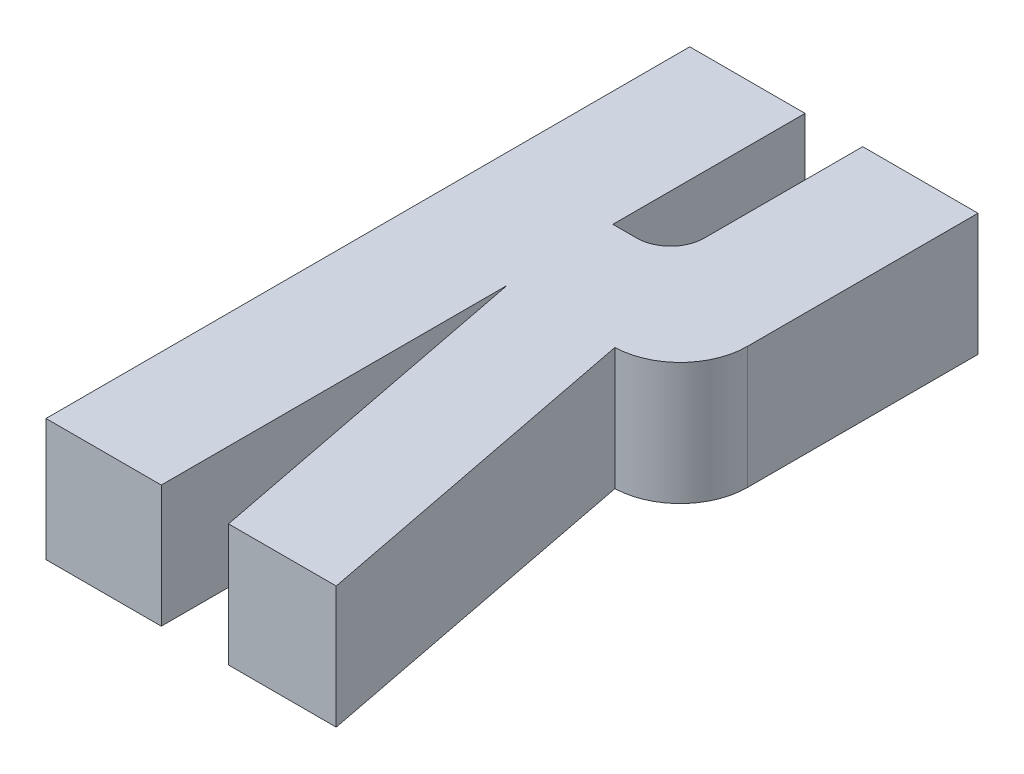
ISO-10303-21;
HEADER;
FILE_DESCRIPTION(('STEP AP214'),'2;1');
FILE_NAME('part.step','',(''),(''),'','','');
FILE_SCHEMA(('AUTOMOTIVE_DESIGN { 1 0 10303 214 1 1 1 1 }'));
ENDSEC;
DATA;
#1=APPLICATION_CONTEXT('core data for automotive mechanical design processes');
#2=APPLICATION_PROTOCOL_DEFINITION('international standard','automotive_design',2000,#1);
#3=PRODUCT_CONTEXT('',#1,'mechanical');
#4=PRODUCT('Part','Part','',(#3));
#5=PRODUCT_RELATED_PRODUCT_CATEGORY('part','',(#4));
#6=PRODUCT_DEFINITION_FORMATION('','',#4);
#7=PRODUCT_DEFINITION_CONTEXT('part definition',#1,'design');
#8=PRODUCT_DEFINITION('design','',#6,#7);
#9=PRODUCT_DEFINITION_SHAPE('','',#8);
#10=(LENGTH_UNIT() NAMED_UNIT(*) SI_UNIT(.MILLI.,.METRE.));
#11=(NAMED_UNIT(*) PLANE_ANGLE_UNIT() SI_UNIT($,.RADIAN.));
#12=(NAMED_UNIT(*) SI_UNIT($,.STERADIAN.) SOLID_ANGLE_UNIT());
#13=UNCERTAINTY_MEASURE_WITH_UNIT(LENGTH_MEASURE(1.E-05),#10,'distance_accuracy_value','');
#14=(GEOMETRIC_REPRESENTATION_CONTEXT(3) GLOBAL_UNCERTAINTY_ASSIGNED_CONTEXT((#13)) GLOBAL_UNIT_ASSIGNED_CONTEXT((#10,
#11,#12)) REPRESENTATION_CONTEXT('',''));
#15=CARTESIAN_POINT('',(0.,0.,0.));
#16=DIRECTION('',(0.,0.,1.));
#17=DIRECTION('',(1.,0.,0.));
#18=AXIS2_PLACEMENT_3D('',#15,#16,#17);
#19=CARTESIAN_POINT('',(795.538613054072,-71.,1297.8980276768));
#20=DIRECTION('',(1.,0.,0.));
#21=DIRECTION('',(0.,0.,-1.));
#22=AXIS2_PLACEMENT_3D('',#19,#20,#21);
#23=PLANE('',#22);
#24=DIRECTION('',(0.,0.,1.));
#25=VECTOR('',#24,1.);
#26=CARTESIAN_POINT('',(795.538613054072,-79.,1297.8980276768));
#27=LINE('',#26,#25);
#28=CARTESIAN_POINT('',(795.538613054072,-79.,1297.8980276768));
#29=VERTEX_POINT('',#28);
#30=CARTESIAN_POINT('',(795.538613054072,-79.,1340.0191783547));
#31=VERTEX_POINT('',#30);
#32=EDGE_CURVE('E123',#29,#31,#27,.T.);
#33=ORIENTED_EDGE('',*,*,#32,.T.);
#34=DIRECTION('',(0.,-1.,0.));
#35=VECTOR('',#34,1.);
#36=CARTESIAN_POINT('',(795.538613054072,-71.,1340.0191783547));
#37=LINE('',#36,#35);
#38=CARTESIAN_POINT('',(795.538613054072,-71.,1340.0191783547));
#39=VERTEX_POINT('',#38);
#40=EDGE_CURVE('E11',#39,#31,#37,.T.);
#41=ORIENTED_EDGE('',*,*,#40,.F.);
#42=DIRECTION('',(0.,0.,1.));
#43=VECTOR('',#42,1.);
#44=CARTESIAN_POINT('',(795.538613054072,-71.,1297.8980276768));
#45=LINE('',#44,#43);
#46=CARTESIAN_POINT('',(795.538613054072,-71.,1297.8980276768));
#47=VERTEX_POINT('',#46);
#48=EDGE_CURVE('E142',#47,#39,#45,.T.);
#49=ORIENTED_EDGE('',*,*,#48,.F.);
#50=DIRECTION('',(0.,-1.,0.));
#51=VECTOR('',#50,1.);
#52=CARTESIAN_POINT('',(795.538613054072,-71.,1297.8980276768));
#53=LINE('',#52,#51);
#54=EDGE_CURVE('E30',#47,#29,#53,.T.);
#55=ORIENTED_EDGE('',*,*,#54,.T.);
#56=EDGE_LOOP('',(#33,#41,#49,#55));
#57=FACE_BOUND('',#56,.T.);
#58=ADVANCED_FACE('F16',(#57),#23,.F.);
#59=CARTESIAN_POINT('',(795.538613054072,-71.,1340.0191783547));
#60=DIRECTION('',(0.,0.,-1.));
#61=DIRECTION('',(-1.,0.,0.));
#62=AXIS2_PLACEMENT_3D('',#59,#60,#61);
#63=PLANE('',#62);
#64=DIRECTION('',(1.,0.,0.));
#65=VECTOR('',#64,1.);
#66=CARTESIAN_POINT('',(795.538613054072,-79.,1340.0191783547));
#67=LINE('',#66,#65);
#68=CARTESIAN_POINT('',(803.082699742652,-79.,1340.0191783547));
#69=VERTEX_POINT('',#68);
#70=EDGE_CURVE('E119',#31,#69,#67,.T.);
#71=ORIENTED_EDGE('',*,*,#70,.T.);
#72=DIRECTION('',(0.,-1.,0.));
#73=VECTOR('',#72,1.);
#74=CARTESIAN_POINT('',(803.082699742652,-71.,1340.0191783547));
#75=LINE('',#74,#73);
#76=CARTESIAN_POINT('',(803.082699742652,-71.,1340.0191783547));
#77=VERTEX_POINT('',#76);
#78=EDGE_CURVE('E23',#77,#69,#75,.T.);
#79=ORIENTED_EDGE('',*,*,#78,.F.);
#80=DIRECTION('',(1.,0.,0.));
#81=VECTOR('',#80,1.);
#82=CARTESIAN_POINT('',(795.538613054072,-71.,1340.0191783547));
#83=LINE('',#82,#81);
#84=EDGE_CURVE('E132',#39,#77,#83,.T.);
#85=ORIENTED_EDGE('',*,*,#84,.F.);
#86=ORIENTED_EDGE('',*,*,#40,.T.);
#87=EDGE_LOOP('',(#71,#79,#85,#86));
#88=FACE_BOUND('',#87,.T.);
#89=ADVANCED_FACE('F131',(#88),#63,.F.);
#90=CARTESIAN_POINT('',(803.082699742652,-71.,1340.0191783547));
#91=DIRECTION('',(-1.,0.,0.));
#92=DIRECTION('',(0.,0.,1.));
#93=AXIS2_PLACEMENT_3D('',#90,#91,#92);
#94=PLANE('',#93);
#95=DIRECTION('',(0.,0.,-1.));
#96=VECTOR('',#95,1.);
#97=CARTESIAN_POINT('',(803.082699742652,-79.,1340.0191783547));
#98=LINE('',#97,#96);
#99=CARTESIAN_POINT('',(803.082699742652,-79.,1317.38691828896));
#100=VERTEX_POINT('',#99);
#101=EDGE_CURVE('E125',#69,#100,#98,.T.);
#102=ORIENTED_EDGE('',*,*,#101,.T.);
#103=DIRECTION('',(0.,-1.,0.));
#104=VECTOR('',#103,1.);
#105=CARTESIAN_POINT('',(803.082699742652,-71.,1317.38691828896));
#106=LINE('',#105,#104);
#107=CARTESIAN_POINT('',(803.082699742652,-71.,1317.38691828896));
#108=VERTEX_POINT('',#107);
#109=EDGE_CURVE('E193',#108,#100,#106,.T.);
#110=ORIENTED_EDGE('',*,*,#109,.F.);
#111=DIRECTION('',(0.,0.,-1.));
#112=VECTOR('',#111,1.);
#113=CARTESIAN_POINT('',(803.082699742652,-71.,1340.0191783547));
#114=LINE('',#113,#112);
#115=EDGE_CURVE('E141',#77,#108,#114,.T.);
#116=ORIENTED_EDGE('',*,*,#115,.F.);
#117=ORIENTED_EDGE('',*,*,#78,.T.);
#118=EDGE_LOOP('',(#102,#110,#116,#117));
#119=FACE_BOUND('',#118,.T.);
#120=ADVANCED_FACE('F197',(#119),#94,.F.);
#121=CARTESIAN_POINT('',(803.082699742652,-71.,1317.38691828896));
#122=DIRECTION('',(0.981627183447664,0.,-0.190808995376545));
#123=DIRECTION('',(-0.190808995376545,0.,-0.981627183447664));
#124=AXIS2_PLACEMENT_3D('',#121,#122,#123);
#125=PLANE('',#124);
#126=DIRECTION('',(0.190808995376545,0.,0.981627183447664));
#127=VECTOR('',#126,1.);
#128=CARTESIAN_POINT('',(803.082699742652,-79.,1317.38691828896));
#129=LINE('',#128,#127);
#130=CARTESIAN_POINT('',(807.481965450715,-79.,1340.0191783547));
#131=VERTEX_POINT('',#130);
#132=EDGE_CURVE('E234',#100,#131,#129,.T.);
#133=ORIENTED_EDGE('',*,*,#132,.T.);
#134=DIRECTION('',(0.,-1.,0.));
#135=VECTOR('',#134,1.);
#136=CARTESIAN_POINT('',(807.481965450715,-71.,1340.0191783547));
#137=LINE('',#136,#135);
#138=CARTESIAN_POINT('',(807.481965450715,-71.,1340.0191783547));
#139=VERTEX_POINT('',#138);
#140=EDGE_CURVE('E190',#139,#131,#137,.T.);
#141=ORIENTED_EDGE('',*,*,#140,.F.);
#142=DIRECTION('',(0.190808995376545,0.,0.981627183447664));
#143=VECTOR('',#142,1.);
#144=CARTESIAN_POINT('',(803.082699742652,-71.,1317.38691828896));
#145=LINE('',#144,#143);
#146=EDGE_CURVE('E144',#108,#139,#145,.T.);
#147=ORIENTED_EDGE('',*,*,#146,.F.);
#148=ORIENTED_EDGE('',*,*,#109,.T.);
#149=EDGE_LOOP('',(#133,#141,#147,#148));
#150=FACE_BOUND('',#149,.T.);
#151=ADVANCED_FACE('F237',(#150),#125,.F.);
#152=CARTESIAN_POINT('',(807.481965450715,-71.,1340.0191783547));
#153=DIRECTION('',(0.,0.,-1.));
#154=DIRECTION('',(-1.,0.,0.));
#155=AXIS2_PLACEMENT_3D('',#152,#153,#154);
#156=PLANE('',#155);
#157=DIRECTION('',(1.,0.,0.));
#158=VECTOR('',#157,1.);
#159=CARTESIAN_POINT('',(807.481965450715,-79.,1340.0191783547));
#160=LINE('',#159,#158);
#161=CARTESIAN_POINT('',(814.526811920407,-79.,1340.0191783547));
#162=VERTEX_POINT('',#161);
#163=EDGE_CURVE('E231',#131,#162,#160,.T.);
#164=ORIENTED_EDGE('',*,*,#163,.T.);
#165=DIRECTION('',(0.,-1.,0.));
#166=VECTOR('',#165,1.);
#167=CARTESIAN_POINT('',(814.526811920407,-71.,1340.0191783547));
#168=LINE('',#167,#166);
#169=CARTESIAN_POINT('',(814.526811920407,-71.,1340.0191783547));
#170=VERTEX_POINT('',#169);
#171=EDGE_CURVE('E188',#170,#162,#168,.T.);
#172=ORIENTED_EDGE('',*,*,#171,.F.);
#173=DIRECTION('',(1.,0.,0.));
#174=VECTOR('',#173,1.);
#175=CARTESIAN_POINT('',(807.481965450715,-71.,1340.0191783547));
#176=LINE('',#175,#174);
#177=EDGE_CURVE('E146',#139,#170,#176,.T.);
#178=ORIENTED_EDGE('',*,*,#177,.F.);
#179=ORIENTED_EDGE('',*,*,#140,.T.);
#180=EDGE_LOOP('',(#164,#172,#178,#179));
#181=FACE_BOUND('',#180,.T.);
#182=ADVANCED_FACE('F241',(#181),#156,.F.);
#183=CARTESIAN_POINT('',(810.12717824107,-71.,1317.38502524088));
#184=DIRECTION('',(0.981627183447664,0.,-0.190808995376545));
#185=DIRECTION('',(-0.190808995376545,0.,-0.981627183447664));
#186=AXIS2_PLACEMENT_3D('',#183,#184,#185);
#187=PLANE('',#186);
#188=DIRECTION('',(0.190808995376545,0.,0.981627183447664));
#189=VECTOR('',#188,1.);
#190=CARTESIAN_POINT('',(810.12717824107,-79.,1317.38502524088));
#191=LINE('',#190,#189);
#192=CARTESIAN_POINT('',(810.12717824107,-79.,1317.38502524088));
#193=VERTEX_POINT('',#192);
#194=EDGE_CURVE('E228',#193,#162,#191,.T.);
#195=ORIENTED_EDGE('',*,*,#194,.F.);
#196=DIRECTION('',(0.,-1.,0.));
#197=VECTOR('',#196,1.);
#198=CARTESIAN_POINT('',(810.12717824107,-71.,1317.38502524088));
#199=LINE('',#198,#197);
#200=CARTESIAN_POINT('',(810.12717824107,-71.,1317.38502524088));
#201=VERTEX_POINT('',#200);
#202=EDGE_CURVE('E186',#201,#193,#199,.T.);
#203=ORIENTED_EDGE('',*,*,#202,.F.);
#204=DIRECTION('',(0.190808995376545,0.,0.981627183447664));
#205=VECTOR('',#204,1.);
#206=CARTESIAN_POINT('',(810.12717824107,-71.,1317.38502524088));
#207=LINE('',#206,#205);
#208=EDGE_CURVE('E148',#201,#170,#207,.T.);
#209=ORIENTED_EDGE('',*,*,#208,.T.);
#210=ORIENTED_EDGE('',*,*,#171,.T.);
#211=EDGE_LOOP('',(#195,#203,#209,#210));
#212=FACE_BOUND('',#211,.T.);
#213=ADVANCED_FACE('F247',(#212),#187,.T.);
#214=CARTESIAN_POINT('',(809.998112540516,-71.,1312.98620105396));
#215=DIRECTION('',(0.,-1.,0.));
#216=DIRECTION('',(0.,0.,-1.));
#217=AXIS2_PLACEMENT_3D('',#214,#215,#216);
#218=CYLINDRICAL_SURFACE('',#217,4.40071723500474);
#219=CARTESIAN_POINT('',(809.998112540516,-79.,1312.98620105396));
#220=DIRECTION('',(0.,-1.,0.));
#221=DIRECTION('',(1.,0.,0.));
#222=AXIS2_PLACEMENT_3D('',#219,#220,#221);
#223=CIRCLE('',#222,4.40071723500474);
#224=CARTESIAN_POINT('',(814.398829775521,-79.,1312.98620105396));
#225=VERTEX_POINT('',#224);
#226=EDGE_CURVE('E225',#225,#193,#223,.T.);
#227=ORIENTED_EDGE('',*,*,#226,.F.);
#228=DIRECTION('',(0.,-1.,0.));
#229=VECTOR('',#228,1.);
#230=CARTESIAN_POINT('',(814.398829775521,-71.,1312.98620105396));
#231=LINE('',#230,#229);
#232=CARTESIAN_POINT('',(814.398829775521,-71.,1312.98620105396));
#233=VERTEX_POINT('',#232);
#234=EDGE_CURVE('E184',#233,#225,#231,.T.);
#235=ORIENTED_EDGE('',*,*,#234,.F.);
#236=CARTESIAN_POINT('',(809.998112540516,-71.,1312.98620105396));
#237=DIRECTION('',(0.,-1.,0.));
#238=DIRECTION('',(1.,0.,0.));
#239=AXIS2_PLACEMENT_3D('',#236,#237,#238);
#240=CIRCLE('',#239,4.40071723500474);
#241=EDGE_CURVE('E151',#233,#201,#240,.T.);
#242=ORIENTED_EDGE('',*,*,#241,.T.);
#243=ORIENTED_EDGE('',*,*,#202,.T.);
#244=EDGE_LOOP('',(#227,#235,#242,#243));
#245=FACE_BOUND('',#244,.T.);
#246=ADVANCED_FACE('F251',(#245),#218,.T.);
#247=CARTESIAN_POINT('',(814.398829775521,-71.,1312.98620105396));
#248=DIRECTION('',(-1.,0.,0.));
#249=DIRECTION('',(0.,0.,1.));
#250=AXIS2_PLACEMENT_3D('',#247,#248,#249);
#251=PLANE('',#250);
#252=DIRECTION('',(0.,0.,-1.));
#253=VECTOR('',#252,1.);
#254=CARTESIAN_POINT('',(814.398829775521,-79.,1312.98620105396));
#255=LINE('',#254,#253);
#256=CARTESIAN_POINT('',(814.398829775521,-79.,1297.8980276768));
#257=VERTEX_POINT('',#256);
#258=EDGE_CURVE('E222',#225,#257,#255,.T.);
#259=ORIENTED_EDGE('',*,*,#258,.T.);
#260=DIRECTION('',(0.,-1.,0.));
#261=VECTOR('',#260,1.);
#262=CARTESIAN_POINT('',(814.398829775521,-71.,1297.8980276768));
#263=LINE('',#262,#261);
#264=CARTESIAN_POINT('',(814.398829775521,-71.,1297.8980276768));
#265=VERTEX_POINT('',#264);
#266=EDGE_CURVE('E182',#265,#257,#263,.T.);
#267=ORIENTED_EDGE('',*,*,#266,.F.);
#268=DIRECTION('',(0.,0.,-1.));
#269=VECTOR('',#268,1.);
#270=CARTESIAN_POINT('',(814.398829775521,-71.,1312.98620105396));
#271=LINE('',#270,#269);
#272=EDGE_CURVE('E154',#233,#265,#271,.T.);
#273=ORIENTED_EDGE('',*,*,#272,.F.);
#274=ORIENTED_EDGE('',*,*,#234,.T.);
#275=EDGE_LOOP('',(#259,#267,#273,#274));
#276=FACE_BOUND('',#275,.T.);
#277=ADVANCED_FACE('F255',(#276),#251,.F.);
#278=CARTESIAN_POINT('',(806.854743086941,-71.,1297.8980276768));
#279=DIRECTION('',(0.,0.,-1.));
#280=DIRECTION('',(-1.,0.,0.));
#281=AXIS2_PLACEMENT_3D('',#278,#279,#280);
#282=PLANE('',#281);
#283=DIRECTION('',(1.,0.,0.));
#284=VECTOR('',#283,1.);
#285=CARTESIAN_POINT('',(806.854743086941,-79.,1297.8980276768));
#286=LINE('',#285,#284);
#287=CARTESIAN_POINT('',(806.854743086941,-79.,1297.8980276768));
#288=VERTEX_POINT('',#287);
#289=EDGE_CURVE('E219',#288,#257,#286,.T.);
#290=ORIENTED_EDGE('',*,*,#289,.F.);
#291=DIRECTION('',(0.,-1.,0.));
#292=VECTOR('',#291,1.);
#293=CARTESIAN_POINT('',(806.854743086941,-71.,1297.8980276768));
#294=LINE('',#293,#292);
#295=CARTESIAN_POINT('',(806.854743086941,-71.,1297.8980276768));
#296=VERTEX_POINT('',#295);
#297=EDGE_CURVE('E180',#296,#288,#294,.T.);
#298=ORIENTED_EDGE('',*,*,#297,.F.);
#299=DIRECTION('',(1.,0.,0.));
#300=VECTOR('',#299,1.);
#301=CARTESIAN_POINT('',(806.854743086941,-71.,1297.8980276768));
#302=LINE('',#301,#300);
#303=EDGE_CURVE('E156',#296,#265,#302,.T.);
#304=ORIENTED_EDGE('',*,*,#303,.T.);
#305=ORIENTED_EDGE('',*,*,#266,.T.);
#306=EDGE_LOOP('',(#290,#298,#304,#305));
#307=FACE_BOUND('',#306,.T.);
#308=ADVANCED_FACE('F270',(#307),#282,.T.);
#309=CARTESIAN_POINT('',(806.854743086941,-71.,1308.2711468736));
#310=DIRECTION('',(-1.,0.,0.));
#311=DIRECTION('',(0.,0.,1.));
#312=AXIS2_PLACEMENT_3D('',#309,#310,#311);
#313=PLANE('',#312);
#314=DIRECTION('',(0.,0.,-1.));
#315=VECTOR('',#314,1.);
#316=CARTESIAN_POINT('',(806.854743086941,-79.,1308.2711468736));
#317=LINE('',#316,#315);
#318=CARTESIAN_POINT('',(806.854743086941,-79.,1308.2711468736));
#319=VERTEX_POINT('',#318);
#320=EDGE_CURVE('E216',#319,#288,#317,.T.);
#321=ORIENTED_EDGE('',*,*,#320,.F.);
#322=DIRECTION('',(0.,-1.,0.));
#323=VECTOR('',#322,1.);
#324=CARTESIAN_POINT('',(806.854743086941,-71.,1308.2711468736));
#325=LINE('',#324,#323);
#326=CARTESIAN_POINT('',(806.854743086941,-71.,1308.2711468736));
#327=VERTEX_POINT('',#326);
#328=EDGE_CURVE('E178',#327,#319,#325,.T.);
#329=ORIENTED_EDGE('',*,*,#328,.F.);
#330=DIRECTION('',(0.,0.,-1.));
#331=VECTOR('',#330,1.);
#332=CARTESIAN_POINT('',(806.854743086941,-71.,1308.2711468736));
#333=LINE('',#332,#331);
#334=EDGE_CURVE('E159',#327,#296,#333,.T.);
#335=ORIENTED_EDGE('',*,*,#334,.T.);
#336=ORIENTED_EDGE('',*,*,#297,.T.);
#337=EDGE_LOOP('',(#321,#329,#335,#336));
#338=FACE_BOUND('',#337,.T.);
#339=ADVANCED_FACE('F261',(#338),#313,.T.);
#340=CARTESIAN_POINT('',(804.654384469439,-71.,1308.2711468736));
#341=DIRECTION('',(0.,-1.,0.));
#342=DIRECTION('',(0.,0.,-1.));
#343=AXIS2_PLACEMENT_3D('',#340,#341,#342);
#344=CYLINDRICAL_SURFACE('',#343,2.20035861750237);
#345=CARTESIAN_POINT('',(804.654384469439,-79.,1308.2711468736));
#346=DIRECTION('',(0.,-1.,0.));
#347=DIRECTION('',(1.,0.,0.));
#348=AXIS2_PLACEMENT_3D('',#345,#346,#347);
#349=CIRCLE('',#348,2.20035861750237);
#350=CARTESIAN_POINT('',(804.654384469439,-79.,1310.4715054911));
#351=VERTEX_POINT('',#350);
#352=EDGE_CURVE('E211',#319,#351,#349,.T.);
#353=ORIENTED_EDGE('',*,*,#352,.T.);
#354=DIRECTION('',(0.,-1.,0.));
#355=VECTOR('',#354,1.);
#356=CARTESIAN_POINT('',(804.654384469439,-71.,1310.4715054911));
#357=LINE('',#356,#355);
#358=CARTESIAN_POINT('',(804.654384469439,-71.,1310.4715054911));
#359=VERTEX_POINT('',#358);
#360=EDGE_CURVE('E176',#359,#351,#357,.T.);
#361=ORIENTED_EDGE('',*,*,#360,.F.);
#362=CARTESIAN_POINT('',(804.654384469439,-71.,1308.2711468736));
#363=DIRECTION('',(0.,-1.,0.));
#364=DIRECTION('',(1.,0.,0.));
#365=AXIS2_PLACEMENT_3D('',#362,#363,#364);
#366=CIRCLE('',#365,2.20035861750237);
#367=EDGE_CURVE('E162',#327,#359,#366,.T.);
#368=ORIENTED_EDGE('',*,*,#367,.F.);
#369=ORIENTED_EDGE('',*,*,#328,.T.);
#370=EDGE_LOOP('',(#353,#361,#368,#369));
#371=FACE_BOUND('',#370,.T.);
#372=ADVANCED_FACE('F267',(#371),#344,.F.);
#373=CARTESIAN_POINT('',(803.082699742652,-71.,1310.4715054911));
#374=DIRECTION('',(0.,0.,-1.));
#375=DIRECTION('',(-1.,0.,0.));
#376=AXIS2_PLACEMENT_3D('',#373,#374,#375);
#377=PLANE('',#376);
#378=DIRECTION('',(1.,0.,0.));
#379=VECTOR('',#378,1.);
#380=CARTESIAN_POINT('',(803.082699742652,-79.,1310.4715054911));
#381=LINE('',#380,#379);
#382=CARTESIAN_POINT('',(803.082699742652,-79.,1310.4715054911));
#383=VERTEX_POINT('',#382);
#384=EDGE_CURVE('E210',#383,#351,#381,.T.);
#385=ORIENTED_EDGE('',*,*,#384,.F.);
#386=DIRECTION('',(0.,-1.,0.));
#387=VECTOR('',#386,1.);
#388=CARTESIAN_POINT('',(803.082699742652,-71.,1310.4715054911));
#389=LINE('',#388,#387);
#390=CARTESIAN_POINT('',(803.082699742652,-71.,1310.4715054911));
#391=VERTEX_POINT('',#390);
#392=EDGE_CURVE('E174',#391,#383,#389,.T.);
#393=ORIENTED_EDGE('',*,*,#392,.F.);
#394=DIRECTION('',(1.,0.,0.));
#395=VECTOR('',#394,1.);
#396=CARTESIAN_POINT('',(803.082699742652,-71.,1310.4715054911));
#397=LINE('',#396,#395);
#398=EDGE_CURVE('E164',#391,#359,#397,.T.);
#399=ORIENTED_EDGE('',*,*,#398,.T.);
#400=ORIENTED_EDGE('',*,*,#360,.T.);
#401=EDGE_LOOP('',(#385,#393,#399,#400));
#402=FACE_BOUND('',#401,.T.);
#403=ADVANCED_FACE('F269',(#402),#377,.T.);
#404=CARTESIAN_POINT('',(803.082699742652,-71.,1310.4715054911));
#405=DIRECTION('',(-1.,0.,0.));
#406=DIRECTION('',(0.,0.,1.));
#407=AXIS2_PLACEMENT_3D('',#404,#405,#406);
#408=PLANE('',#407);
#409=DIRECTION('',(0.,0.,-1.));
#410=VECTOR('',#409,1.);
#411=CARTESIAN_POINT('',(803.082699742652,-79.,1310.4715054911));
#412=LINE('',#411,#410);
#413=CARTESIAN_POINT('',(803.082699742652,-79.,1297.8980276768));
#414=VERTEX_POINT('',#413);
#415=EDGE_CURVE('E206',#383,#414,#412,.T.);
#416=ORIENTED_EDGE('',*,*,#415,.T.);
#417=DIRECTION('',(0.,-1.,0.));
#418=VECTOR('',#417,1.);
#419=CARTESIAN_POINT('',(803.082699742652,-71.,1297.8980276768));
#420=LINE('',#419,#418);
#421=CARTESIAN_POINT('',(803.082699742652,-71.,1297.8980276768));
#422=VERTEX_POINT('',#421);
#423=EDGE_CURVE('E172',#422,#414,#420,.T.);
#424=ORIENTED_EDGE('',*,*,#423,.F.);
#425=DIRECTION('',(0.,0.,-1.));
#426=VECTOR('',#425,1.);
#427=CARTESIAN_POINT('',(803.082699742652,-71.,1310.4715054911));
#428=LINE('',#427,#426);
#429=EDGE_CURVE('E38',#391,#422,#428,.T.);
#430=ORIENTED_EDGE('',*,*,#429,.F.);
#431=ORIENTED_EDGE('',*,*,#392,.T.);
#432=EDGE_LOOP('',(#416,#424,#430,#431));
#433=FACE_BOUND('',#432,.T.);
#434=ADVANCED_FACE('F207',(#433),#408,.F.);
#435=CARTESIAN_POINT('',(795.538613054072,-71.,1297.8980276768));
#436=DIRECTION('',(0.,0.,-1.));
#437=DIRECTION('',(-1.,0.,0.));
#438=AXIS2_PLACEMENT_3D('',#435,#436,#437);
#439=PLANE('',#438);
#440=DIRECTION('',(1.,0.,0.));
#441=VECTOR('',#440,1.);
#442=CARTESIAN_POINT('',(795.538613054072,-79.,1297.8980276768));
#443=LINE('',#442,#441);
#444=EDGE_CURVE('E138',#29,#414,#443,.T.);
#445=ORIENTED_EDGE('',*,*,#444,.F.);
#446=ORIENTED_EDGE('',*,*,#54,.F.);
#447=DIRECTION('',(1.,0.,0.));
#448=VECTOR('',#447,1.);
#449=CARTESIAN_POINT('',(795.538613054072,-71.,1297.8980276768));
#450=LINE('',#449,#448);
#451=EDGE_CURVE('E168',#47,#422,#450,.T.);
#452=ORIENTED_EDGE('',*,*,#451,.T.);
#453=ORIENTED_EDGE('',*,*,#423,.T.);
#454=EDGE_LOOP('',(#445,#446,#452,#453));
#455=FACE_BOUND('',#454,.T.);
#456=ADVANCED_FACE('F202',(#455),#439,.T.);
#457=CARTESIAN_POINT('',(809.998112540516,-71.,1312.98620105396));
#458=DIRECTION('',(0.,-1.,0.));
#459=DIRECTION('',(0.,0.,-1.));
#460=AXIS2_PLACEMENT_3D('',#457,#458,#459);
#461=PLANE('',#460);
#462=ORIENTED_EDGE('',*,*,#48,.T.);
#463=ORIENTED_EDGE('',*,*,#84,.T.);
#464=ORIENTED_EDGE('',*,*,#115,.T.);
#465=ORIENTED_EDGE('',*,*,#146,.T.);
#466=ORIENTED_EDGE('',*,*,#177,.T.);
#467=ORIENTED_EDGE('',*,*,#208,.F.);
#468=ORIENTED_EDGE('',*,*,#241,.F.);
#469=ORIENTED_EDGE('',*,*,#272,.T.);
#470=ORIENTED_EDGE('',*,*,#303,.F.);
#471=ORIENTED_EDGE('',*,*,#334,.F.);
#472=ORIENTED_EDGE('',*,*,#367,.T.);
#473=ORIENTED_EDGE('',*,*,#398,.F.);
#474=ORIENTED_EDGE('',*,*,#429,.T.);
#475=ORIENTED_EDGE('',*,*,#451,.F.);
#476=EDGE_LOOP('',(#462,#463,#464,#465,#466,#467,#468,#469,#470,#471,#472,#473,#474,#475));
#477=FACE_BOUND('',#476,.T.);
#478=ADVANCED_FACE('F200',(#477),#461,.F.);
#479=CARTESIAN_POINT('',(809.998112540516,-79.,1312.98620105396));
#480=DIRECTION('',(0.,-1.,0.));
#481=DIRECTION('',(0.,0.,-1.));
#482=AXIS2_PLACEMENT_3D('',#479,#480,#481);
#483=PLANE('',#482);
#484=ORIENTED_EDGE('',*,*,#32,.F.);
#485=ORIENTED_EDGE('',*,*,#444,.T.);
#486=ORIENTED_EDGE('',*,*,#415,.F.);
#487=ORIENTED_EDGE('',*,*,#384,.T.);
#488=ORIENTED_EDGE('',*,*,#352,.F.);
#489=ORIENTED_EDGE('',*,*,#320,.T.);
#490=ORIENTED_EDGE('',*,*,#289,.T.);
#491=ORIENTED_EDGE('',*,*,#258,.F.);
#492=ORIENTED_EDGE('',*,*,#226,.T.);
#493=ORIENTED_EDGE('',*,*,#194,.T.);
#494=ORIENTED_EDGE('',*,*,#163,.F.);
#495=ORIENTED_EDGE('',*,*,#132,.F.);
#496=ORIENTED_EDGE('',*,*,#101,.F.);
#497=ORIENTED_EDGE('',*,*,#70,.F.);
#498=EDGE_LOOP('',(#484,#485,#486,#487,#488,#489,#490,#491,#492,#493,#494,#495,#496,#497));
#499=FACE_BOUND('',#498,.T.);
#500=ADVANCED_FACE('F120',(#499),#483,.T.);
#501=CLOSED_SHELL('',(#58,#89,#120,#151,#182,#213,#246,#277,#308,#339,#372,#403,#434,#456,#478,#500));
#502=MANIFOLD_SOLID_BREP('B1',#501);
#503=ADVANCED_BREP_SHAPE_REPRESENTATION('',(#18,#502),#14);
#504=SHAPE_DEFINITION_REPRESENTATION(#9,#503);
ENDSEC;
END-ISO-10303-21;
